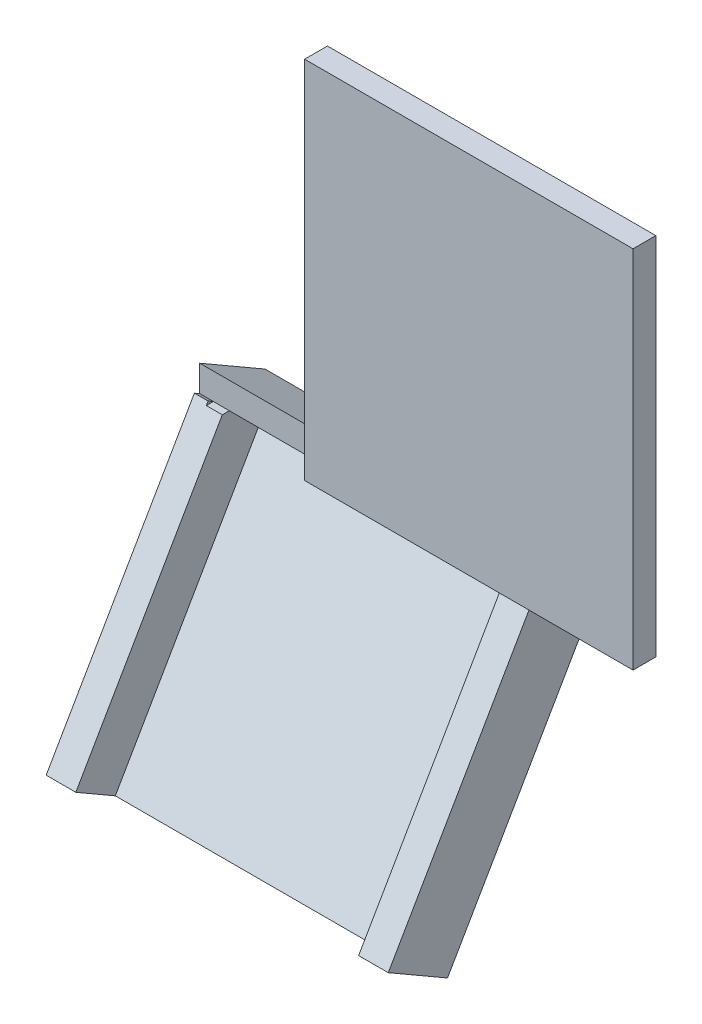
ISO-10303-21;
HEADER;
FILE_DESCRIPTION(('STEP AP214'),'2;1');
FILE_NAME('part.step','',(''),(''),'','','');
FILE_SCHEMA(('AUTOMOTIVE_DESIGN { 1 0 10303 214 1 1 1 1 }'));
ENDSEC;
DATA;
#1=APPLICATION_CONTEXT('core data for automotive mechanical design processes');
#2=APPLICATION_PROTOCOL_DEFINITION('international standard','automotive_design',2000,#1);
#3=PRODUCT_CONTEXT('',#1,'mechanical');
#4=PRODUCT('Part','Part','',(#3));
#5=PRODUCT_RELATED_PRODUCT_CATEGORY('part','',(#4));
#6=PRODUCT_DEFINITION_FORMATION('','',#4);
#7=PRODUCT_DEFINITION_CONTEXT('part definition',#1,'design');
#8=PRODUCT_DEFINITION('design','',#6,#7);
#9=PRODUCT_DEFINITION_SHAPE('','',#8);
#10=(LENGTH_UNIT() NAMED_UNIT(*) SI_UNIT(.MILLI.,.METRE.));
#11=(NAMED_UNIT(*) PLANE_ANGLE_UNIT() SI_UNIT($,.RADIAN.));
#12=(NAMED_UNIT(*) SI_UNIT($,.STERADIAN.) SOLID_ANGLE_UNIT());
#13=UNCERTAINTY_MEASURE_WITH_UNIT(LENGTH_MEASURE(1.E-05),#10,'distance_accuracy_value','');
#14=(GEOMETRIC_REPRESENTATION_CONTEXT(3) GLOBAL_UNCERTAINTY_ASSIGNED_CONTEXT((#13)) GLOBAL_UNIT_ASSIGNED_CONTEXT((#10,
#11,#12)) REPRESENTATION_CONTEXT('',''));
#15=CARTESIAN_POINT('',(0.,0.,0.));
#16=DIRECTION('',(0.,0.,1.));
#17=DIRECTION('',(1.,0.,0.));
#18=AXIS2_PLACEMENT_3D('',#15,#16,#17);
#19=CARTESIAN_POINT('',(0.,0.,1.));
#20=DIRECTION('',(0.,1.,0.));
#21=DIRECTION('',(0.,0.,1.));
#22=AXIS2_PLACEMENT_3D('',#19,#20,#21);
#23=PLANE('',#22);
#24=DIRECTION('',(0.,0.,1.));
#25=VECTOR('',#24,1.);
#26=CARTESIAN_POINT('',(5.,0.,0.));
#27=LINE('',#26,#25);
#28=CARTESIAN_POINT('',(5.,0.,0.));
#29=VERTEX_POINT('',#28);
#30=CARTESIAN_POINT('',(5.,0.,1.));
#31=VERTEX_POINT('',#30);
#32=EDGE_CURVE('E162',#29,#31,#27,.T.);
#33=ORIENTED_EDGE('',*,*,#32,.F.);
#34=DIRECTION('',(1.,0.,0.));
#35=VECTOR('',#34,1.);
#36=CARTESIAN_POINT('',(0.,0.,0.));
#37=LINE('',#36,#35);
#38=CARTESIAN_POINT('',(13.1,0.,0.));
#39=VERTEX_POINT('',#38);
#40=EDGE_CURVE('E179',#29,#39,#37,.T.);
#41=ORIENTED_EDGE('',*,*,#40,.T.);
#42=DIRECTION('',(0.,0.,-1.));
#43=VECTOR('',#42,1.);
#44=CARTESIAN_POINT('',(13.1,0.,0.999999999999999));
#45=LINE('',#44,#43);
#46=CARTESIAN_POINT('',(13.1,0.,0.309401076758494));
#47=VERTEX_POINT('',#46);
#48=EDGE_CURVE('E253',#47,#39,#45,.T.);
#49=ORIENTED_EDGE('',*,*,#48,.F.);
#50=DIRECTION('',(-1.,0.,0.));
#51=VECTOR('',#50,1.);
#52=CARTESIAN_POINT('',(0.,0.,0.309401076758493));
#53=LINE('',#52,#51);
#54=CARTESIAN_POINT('',(14.4,0.,0.309401076758494));
#55=VERTEX_POINT('',#54);
#56=EDGE_CURVE('E255',#55,#47,#53,.T.);
#57=ORIENTED_EDGE('',*,*,#56,.F.);
#58=DIRECTION('',(0.,0.,-1.));
#59=VECTOR('',#58,1.);
#60=CARTESIAN_POINT('',(14.4,0.,1.));
#61=LINE('',#60,#59);
#62=CARTESIAN_POINT('',(14.4,0.,0.));
#63=VERTEX_POINT('',#62);
#64=EDGE_CURVE('E11',#55,#63,#61,.T.);
#65=ORIENTED_EDGE('',*,*,#64,.T.);
#66=DIRECTION('',(-1.,0.,0.));
#67=VECTOR('',#66,1.);
#68=CARTESIAN_POINT('',(19.4,0.,0.));
#69=LINE('',#68,#67);
#70=CARTESIAN_POINT('',(19.4,0.,0.));
#71=VERTEX_POINT('',#70);
#72=EDGE_CURVE('E213',#71,#63,#69,.T.);
#73=ORIENTED_EDGE('',*,*,#72,.F.);
#74=DIRECTION('',(0.,0.,-1.));
#75=VECTOR('',#74,1.);
#76=CARTESIAN_POINT('',(19.4,0.,1.));
#77=LINE('',#76,#75);
#78=CARTESIAN_POINT('',(19.4,0.,1.));
#79=VERTEX_POINT('',#78);
#80=EDGE_CURVE('E321',#79,#71,#77,.T.);
#81=ORIENTED_EDGE('',*,*,#80,.F.);
#82=DIRECTION('',(1.,0.,0.));
#83=VECTOR('',#82,1.);
#84=CARTESIAN_POINT('',(0.,0.,1.));
#85=LINE('',#84,#83);
#86=EDGE_CURVE('E185',#31,#79,#85,.T.);
#87=ORIENTED_EDGE('',*,*,#86,.F.);
#88=EDGE_LOOP('',(#33,#41,#49,#57,#65,#73,#81,#87));
#89=FACE_BOUND('',#88,.T.);
#90=ADVANCED_FACE('F37',(#89),#23,.F.);
#91=CARTESIAN_POINT('',(0.,0.,0.));
#92=DIRECTION('',(0.,0.,-1.));
#93=DIRECTION('',(-1.,0.,0.));
#94=AXIS2_PLACEMENT_3D('',#91,#92,#93);
#95=PLANE('',#94);
#96=DIRECTION('',(-1.,0.,0.));
#97=VECTOR('',#96,1.);
#98=CARTESIAN_POINT('',(0.,1.15470053837924,0.));
#99=LINE('',#98,#97);
#100=CARTESIAN_POINT('',(14.4,1.15470053837923,0.));
#101=VERTEX_POINT('',#100);
#102=CARTESIAN_POINT('',(5.,1.15470053837924,0.));
#103=VERTEX_POINT('',#102);
#104=EDGE_CURVE('E202',#101,#103,#99,.T.);
#105=ORIENTED_EDGE('',*,*,#104,.T.);
#106=DIRECTION('',(0.,-1.,0.));
#107=VECTOR('',#106,1.);
#108=CARTESIAN_POINT('',(5.,16.,0.));
#109=LINE('',#108,#107);
#110=CARTESIAN_POINT('',(5.,16.,0.));
#111=VERTEX_POINT('',#110);
#112=EDGE_CURVE('E165',#111,#103,#109,.T.);
#113=ORIENTED_EDGE('',*,*,#112,.F.);
#114=DIRECTION('',(-1.,0.,0.));
#115=VECTOR('',#114,1.);
#116=CARTESIAN_POINT('',(0.,16.,0.));
#117=LINE('',#116,#115);
#118=CARTESIAN_POINT('',(19.4,16.,0.));
#119=VERTEX_POINT('',#118);
#120=EDGE_CURVE('E178',#119,#111,#117,.T.);
#121=ORIENTED_EDGE('',*,*,#120,.F.);
#122=DIRECTION('',(0.,1.,0.));
#123=VECTOR('',#122,1.);
#124=CARTESIAN_POINT('',(19.4,16.,0.));
#125=LINE('',#124,#123);
#126=EDGE_CURVE('E323',#71,#119,#125,.T.);
#127=ORIENTED_EDGE('',*,*,#126,.F.);
#128=ORIENTED_EDGE('',*,*,#72,.T.);
#129=DIRECTION('',(0.,1.,0.));
#130=VECTOR('',#129,1.);
#131=CARTESIAN_POINT('',(14.4,16.,0.));
#132=LINE('',#131,#130);
#133=EDGE_CURVE('E208',#63,#101,#132,.T.);
#134=ORIENTED_EDGE('',*,*,#133,.T.);
#135=EDGE_LOOP('',(#105,#113,#121,#127,#128,#134));
#136=FACE_BOUND('',#135,.T.);
#137=ADVANCED_FACE('F332',(#136),#95,.T.);
#138=CARTESIAN_POINT('',(0.,16.,1.));
#139=DIRECTION('',(0.,-1.,0.));
#140=DIRECTION('',(0.,0.,-1.));
#141=AXIS2_PLACEMENT_3D('',#138,#139,#140);
#142=PLANE('',#141);
#143=DIRECTION('',(0.,0.,-1.));
#144=VECTOR('',#143,1.);
#145=CARTESIAN_POINT('',(5.,16.,0.));
#146=LINE('',#145,#144);
#147=CARTESIAN_POINT('',(5.,16.,1.));
#148=VERTEX_POINT('',#147);
#149=EDGE_CURVE('E316',#148,#111,#146,.T.);
#150=ORIENTED_EDGE('',*,*,#149,.F.);
#151=DIRECTION('',(-1.,0.,0.));
#152=VECTOR('',#151,1.);
#153=CARTESIAN_POINT('',(0.,16.,1.));
#154=LINE('',#153,#152);
#155=CARTESIAN_POINT('',(19.4,16.,1.));
#156=VERTEX_POINT('',#155);
#157=EDGE_CURVE('E197',#156,#148,#154,.T.);
#158=ORIENTED_EDGE('',*,*,#157,.F.);
#159=DIRECTION('',(0.,0.,1.));
#160=VECTOR('',#159,1.);
#161=CARTESIAN_POINT('',(19.4,16.,1.));
#162=LINE('',#161,#160);
#163=EDGE_CURVE('E325',#119,#156,#162,.T.);
#164=ORIENTED_EDGE('',*,*,#163,.F.);
#165=ORIENTED_EDGE('',*,*,#120,.T.);
#166=EDGE_LOOP('',(#150,#158,#164,#165));
#167=FACE_BOUND('',#166,.T.);
#168=ADVANCED_FACE('F376',(#167),#142,.F.);
#169=CARTESIAN_POINT('',(0.,0.,1.));
#170=DIRECTION('',(0.,0.,-1.));
#171=DIRECTION('',(-1.,0.,0.));
#172=AXIS2_PLACEMENT_3D('',#169,#170,#171);
#173=PLANE('',#172);
#174=DIRECTION('',(0.,1.,0.));
#175=VECTOR('',#174,1.);
#176=CARTESIAN_POINT('',(5.,16.,1.));
#177=LINE('',#176,#175);
#178=EDGE_CURVE('E186',#31,#148,#177,.T.);
#179=ORIENTED_EDGE('',*,*,#178,.F.);
#180=ORIENTED_EDGE('',*,*,#86,.T.);
#181=DIRECTION('',(0.,-1.,0.));
#182=VECTOR('',#181,1.);
#183=CARTESIAN_POINT('',(19.4,16.,1.));
#184=LINE('',#183,#182);
#185=EDGE_CURVE('E212',#156,#79,#184,.T.);
#186=ORIENTED_EDGE('',*,*,#185,.F.);
#187=ORIENTED_EDGE('',*,*,#157,.T.);
#188=EDGE_LOOP('',(#179,#180,#186,#187));
#189=FACE_BOUND('',#188,.T.);
#190=ADVANCED_FACE('F381',(#189),#173,.F.);
#191=CARTESIAN_POINT('',(14.4,0.,1.));
#192=DIRECTION('',(-1.,0.,0.));
#193=DIRECTION('',(0.,0.,1.));
#194=AXIS2_PLACEMENT_3D('',#191,#192,#193);
#195=PLANE('',#194);
#196=ORIENTED_EDGE('',*,*,#133,.F.);
#197=ORIENTED_EDGE('',*,*,#64,.F.);
#198=DIRECTION('',(0.,0.866025403784442,-0.499999999999995));
#199=VECTOR('',#198,1.);
#200=CARTESIAN_POINT('',(14.4,0.133974596215557,0.232050807568872));
#201=LINE('',#200,#199);
#202=CARTESIAN_POINT('',(14.4,-11.1243556529822,6.73205080756881));
#203=VERTEX_POINT('',#202);
#204=EDGE_CURVE('E245',#203,#55,#201,.T.);
#205=ORIENTED_EDGE('',*,*,#204,.F.);
#206=DIRECTION('',(0.,0.499999999999995,0.866025403784442));
#207=VECTOR('',#206,1.);
#208=CARTESIAN_POINT('',(14.4,-11.2583302491977,6.49999999999994));
#209=LINE('',#208,#207);
#210=CARTESIAN_POINT('',(14.4,-12.6243556529822,4.13397459621548));
#211=VERTEX_POINT('',#210);
#212=EDGE_CURVE('E266',#211,#203,#209,.T.);
#213=ORIENTED_EDGE('',*,*,#212,.F.);
#214=DIRECTION('',(0.,-0.866025403784442,0.499999999999995));
#215=VECTOR('',#214,1.);
#216=CARTESIAN_POINT('',(14.4,-1.36602540378443,-2.36602540378445));
#217=LINE('',#216,#215);
#218=CARTESIAN_POINT('',(14.4,-0.499999999999995,-2.86602540378444));
#219=VERTEX_POINT('',#218);
#220=EDGE_CURVE('E268',#219,#211,#217,.T.);
#221=ORIENTED_EDGE('',*,*,#220,.F.);
#222=DIRECTION('',(0.,-0.499999999999995,-0.866025403784442));
#223=VECTOR('',#222,1.);
#224=CARTESIAN_POINT('',(14.4,0.866025403784432,-0.499999999999989));
#225=LINE('',#224,#223);
#226=EDGE_CURVE('E259',#101,#219,#225,.T.);
#227=ORIENTED_EDGE('',*,*,#226,.F.);
#228=EDGE_LOOP('',(#196,#197,#205,#213,#221,#227));
#229=FACE_BOUND('',#228,.T.);
#230=ADVANCED_FACE('F338',(#229),#195,.F.);
#231=CARTESIAN_POINT('',(-0.6,-0.866025403784432,-1.50000000000001));
#232=DIRECTION('',(0.,0.499999999999995,0.866025403784442));
#233=DIRECTION('',(0.,-0.866025403784442,0.499999999999995));
#234=AXIS2_PLACEMENT_3D('',#231,#232,#233);
#235=PLANE('',#234);
#236=DIRECTION('',(1.,0.,0.));
#237=VECTOR('',#236,1.);
#238=CARTESIAN_POINT('',(-0.6,-0.866025403784432,-1.50000000000001));
#239=LINE('',#238,#237);
#240=CARTESIAN_POINT('',(0.700000000000002,-0.866025403784432,-1.50000000000001));
#241=VERTEX_POINT('',#240);
#242=CARTESIAN_POINT('',(13.1,-0.866025403784433,-1.50000000000001));
#243=VERTEX_POINT('',#242);
#244=EDGE_CURVE('E193',#241,#243,#239,.T.);
#245=ORIENTED_EDGE('',*,*,#244,.F.);
#246=DIRECTION('',(0.,0.866025403784442,-0.499999999999995));
#247=VECTOR('',#246,1.);
#248=CARTESIAN_POINT('',(0.7,-0.866025403784433,-1.50000000000001));
#249=LINE('',#248,#247);
#250=CARTESIAN_POINT('',(0.700000000000002,-12.1243556529822,4.99999999999992));
#251=VERTEX_POINT('',#250);
#252=EDGE_CURVE('E60',#251,#241,#249,.T.);
#253=ORIENTED_EDGE('',*,*,#252,.F.);
#254=DIRECTION('',(1.,0.,0.));
#255=VECTOR('',#254,1.);
#256=CARTESIAN_POINT('',(-0.6,-12.1243556529822,4.99999999999992));
#257=LINE('',#256,#255);
#258=CARTESIAN_POINT('',(13.1,-12.1243556529822,4.99999999999992));
#259=VERTEX_POINT('',#258);
#260=EDGE_CURVE('E192',#251,#259,#257,.T.);
#261=ORIENTED_EDGE('',*,*,#260,.T.);
#262=DIRECTION('',(0.,-0.866025403784442,0.499999999999995));
#263=VECTOR('',#262,1.);
#264=CARTESIAN_POINT('',(13.1,-0.866025403784433,-1.50000000000001));
#265=LINE('',#264,#263);
#266=EDGE_CURVE('E241',#243,#259,#265,.T.);
#267=ORIENTED_EDGE('',*,*,#266,.F.);
#268=EDGE_LOOP('',(#245,#253,#261,#267));
#269=FACE_BOUND('',#268,.T.);
#270=ADVANCED_FACE('F386',(#269),#235,.T.);
#271=CARTESIAN_POINT('',(-0.6,0.,0.));
#272=DIRECTION('',(0.,0.866025403784442,-0.499999999999994));
#273=DIRECTION('',(0.,0.499999999999994,0.866025403784442));
#274=AXIS2_PLACEMENT_3D('',#271,#272,#273);
#275=PLANE('',#274);
#276=DIRECTION('',(0.,-0.499999999999995,-0.866025403784442));
#277=VECTOR('',#276,1.);
#278=CARTESIAN_POINT('',(0.7,0.133974596215557,0.232050807568872));
#279=LINE('',#278,#277);
#280=CARTESIAN_POINT('',(0.7,0.,0.));
#281=VERTEX_POINT('',#280);
#282=EDGE_CURVE('E53',#281,#241,#279,.T.);
#283=ORIENTED_EDGE('',*,*,#282,.T.);
#284=ORIENTED_EDGE('',*,*,#244,.T.);
#285=DIRECTION('',(0.,-0.499999999999994,-0.866025403784442));
#286=VECTOR('',#285,1.);
#287=CARTESIAN_POINT('',(13.1,0.,0.));
#288=LINE('',#287,#286);
#289=EDGE_CURVE('E190',#39,#243,#288,.T.);
#290=ORIENTED_EDGE('',*,*,#289,.F.);
#291=ORIENTED_EDGE('',*,*,#40,.F.);
#292=EDGE_CURVE('E172',#281,#29,#37,.T.);
#293=ORIENTED_EDGE('',*,*,#292,.F.);
#294=EDGE_LOOP('',(#283,#284,#290,#291,#293));
#295=FACE_BOUND('',#294,.T.);
#296=ADVANCED_FACE('F188',(#295),#275,.F.);
#297=CARTESIAN_POINT('',(-0.6,0.,0.));
#298=DIRECTION('',(0.,0.,-1.));
#299=DIRECTION('',(-1.,0.,0.));
#300=AXIS2_PLACEMENT_3D('',#297,#298,#299);
#301=PLANE('',#300);
#302=DIRECTION('',(1.,0.,0.));
#303=VECTOR('',#302,1.);
#304=CARTESIAN_POINT('',(-0.6,0.,0.));
#305=LINE('',#304,#303);
#306=CARTESIAN_POINT('',(-0.6,0.,0.));
#307=VERTEX_POINT('',#306);
#308=CARTESIAN_POINT('',(0.,0.,0.));
#309=VERTEX_POINT('',#308);
#310=EDGE_CURVE('E271',#307,#309,#305,.T.);
#311=ORIENTED_EDGE('',*,*,#310,.T.);
#312=DIRECTION('',(-1.,0.,0.));
#313=VECTOR('',#312,1.);
#314=CARTESIAN_POINT('',(5.,0.,0.));
#315=LINE('',#314,#313);
#316=EDGE_CURVE('E176',#281,#309,#315,.T.);
#317=ORIENTED_EDGE('',*,*,#316,.F.);
#318=ORIENTED_EDGE('',*,*,#292,.T.);
#319=EDGE_CURVE('E158',#103,#29,#109,.T.);
#320=ORIENTED_EDGE('',*,*,#319,.F.);
#321=DIRECTION('',(1.,0.,0.));
#322=VECTOR('',#321,1.);
#323=CARTESIAN_POINT('',(-0.6,1.15470053837923,0.));
#324=LINE('',#323,#322);
#325=CARTESIAN_POINT('',(-0.6,1.15470053837923,0.));
#326=VERTEX_POINT('',#325);
#327=EDGE_CURVE('E273',#326,#103,#324,.T.);
#328=ORIENTED_EDGE('',*,*,#327,.F.);
#329=DIRECTION('',(0.,1.,0.));
#330=VECTOR('',#329,1.);
#331=CARTESIAN_POINT('',(-0.6,0.,0.));
#332=LINE('',#331,#330);
#333=EDGE_CURVE('E263',#307,#326,#332,.T.);
#334=ORIENTED_EDGE('',*,*,#333,.F.);
#335=EDGE_LOOP('',(#311,#317,#318,#320,#328,#334));
#336=FACE_BOUND('',#335,.T.);
#337=ADVANCED_FACE('F174',(#336),#301,.F.);
#338=CARTESIAN_POINT('',(-0.6,-11.2583302491977,6.49999999999994));
#339=DIRECTION('',(0.,0.866025403784442,-0.499999999999995));
#340=DIRECTION('',(0.,0.499999999999995,0.866025403784442));
#341=AXIS2_PLACEMENT_3D('',#338,#339,#340);
#342=PLANE('',#341);
#343=ORIENTED_EDGE('',*,*,#212,.T.);
#344=DIRECTION('',(1.,0.,0.));
#345=VECTOR('',#344,1.);
#346=CARTESIAN_POINT('',(14.4,-11.1243556529822,6.73205080756881));
#347=LINE('',#346,#345);
#348=CARTESIAN_POINT('',(13.1,-11.1243556529822,6.73205080756881));
#349=VERTEX_POINT('',#348);
#350=EDGE_CURVE('E244',#349,#203,#347,.T.);
#351=ORIENTED_EDGE('',*,*,#350,.F.);
#352=DIRECTION('',(0.,-0.499999999999995,-0.866025403784442));
#353=VECTOR('',#352,1.);
#354=CARTESIAN_POINT('',(13.1,-11.1243556529822,6.73205080756881));
#355=LINE('',#354,#353);
#356=EDGE_CURVE('E248',#349,#259,#355,.T.);
#357=ORIENTED_EDGE('',*,*,#356,.T.);
#358=ORIENTED_EDGE('',*,*,#260,.F.);
#359=DIRECTION('',(0.,-0.499999999999995,-0.866025403784442));
#360=VECTOR('',#359,1.);
#361=CARTESIAN_POINT('',(0.700000000000002,-11.1243556529822,6.73205080756881));
#362=LINE('',#361,#360);
#363=CARTESIAN_POINT('',(0.700000000000002,-11.1243556529822,6.73205080756881));
#364=VERTEX_POINT('',#363);
#365=EDGE_CURVE('E230',#364,#251,#362,.T.);
#366=ORIENTED_EDGE('',*,*,#365,.F.);
#367=DIRECTION('',(1.,0.,0.));
#368=VECTOR('',#367,1.);
#369=CARTESIAN_POINT('',(-0.6,-11.1243556529822,6.73205080756881));
#370=LINE('',#369,#368);
#371=CARTESIAN_POINT('',(-0.6,-11.1243556529822,6.73205080756881));
#372=VERTEX_POINT('',#371);
#373=EDGE_CURVE('E218',#372,#364,#370,.T.);
#374=ORIENTED_EDGE('',*,*,#373,.F.);
#375=DIRECTION('',(0.,0.499999999999995,0.866025403784442));
#376=VECTOR('',#375,1.);
#377=CARTESIAN_POINT('',(-0.6,-11.2583302491977,6.49999999999994));
#378=LINE('',#377,#376);
#379=CARTESIAN_POINT('',(-0.6,-12.6243556529822,4.13397459621548));
#380=VERTEX_POINT('',#379);
#381=EDGE_CURVE('E256',#380,#372,#378,.T.);
#382=ORIENTED_EDGE('',*,*,#381,.F.);
#383=DIRECTION('',(1.,0.,0.));
#384=VECTOR('',#383,1.);
#385=CARTESIAN_POINT('',(-0.6,-12.6243556529822,4.13397459621548));
#386=LINE('',#385,#384);
#387=EDGE_CURVE('E265',#380,#211,#386,.T.);
#388=ORIENTED_EDGE('',*,*,#387,.T.);
#389=EDGE_LOOP('',(#343,#351,#357,#358,#366,#374,#382,#388));
#390=FACE_BOUND('',#389,.T.);
#391=ADVANCED_FACE('F356',(#390),#342,.F.);
#392=CARTESIAN_POINT('',(-0.6,0.866025403784432,-0.499999999999989));
#393=DIRECTION('',(0.,-0.866025403784442,0.499999999999995));
#394=DIRECTION('',(0.,-0.499999999999995,-0.866025403784442));
#395=AXIS2_PLACEMENT_3D('',#392,#393,#394);
#396=PLANE('',#395);
#397=ORIENTED_EDGE('',*,*,#226,.T.);
#398=DIRECTION('',(1.,0.,0.));
#399=VECTOR('',#398,1.);
#400=CARTESIAN_POINT('',(-0.6,-0.499999999999995,-2.86602540378444));
#401=LINE('',#400,#399);
#402=CARTESIAN_POINT('',(-0.6,-0.499999999999995,-2.86602540378444));
#403=VERTEX_POINT('',#402);
#404=EDGE_CURVE('E274',#403,#219,#401,.T.);
#405=ORIENTED_EDGE('',*,*,#404,.F.);
#406=DIRECTION('',(0.,-0.499999999999995,-0.866025403784442));
#407=VECTOR('',#406,1.);
#408=CARTESIAN_POINT('',(-0.6,0.866025403784432,-0.499999999999989));
#409=LINE('',#408,#407);
#410=EDGE_CURVE('E261',#326,#403,#409,.T.);
#411=ORIENTED_EDGE('',*,*,#410,.F.);
#412=ORIENTED_EDGE('',*,*,#327,.T.);
#413=ORIENTED_EDGE('',*,*,#104,.F.);
#414=EDGE_LOOP('',(#397,#405,#411,#412,#413));
#415=FACE_BOUND('',#414,.T.);
#416=ADVANCED_FACE('F291',(#415),#396,.F.);
#417=CARTESIAN_POINT('',(-0.6,-1.36602540378443,-2.36602540378445));
#418=DIRECTION('',(0.,0.499999999999995,0.866025403784442));
#419=DIRECTION('',(0.,-0.866025403784442,0.499999999999995));
#420=AXIS2_PLACEMENT_3D('',#417,#418,#419);
#421=PLANE('',#420);
#422=ORIENTED_EDGE('',*,*,#220,.T.);
#423=ORIENTED_EDGE('',*,*,#387,.F.);
#424=DIRECTION('',(0.,-0.866025403784442,0.499999999999995));
#425=VECTOR('',#424,1.);
#426=CARTESIAN_POINT('',(-0.6,-1.36602540378443,-2.36602540378445));
#427=LINE('',#426,#425);
#428=EDGE_CURVE('E258',#403,#380,#427,.T.);
#429=ORIENTED_EDGE('',*,*,#428,.F.);
#430=ORIENTED_EDGE('',*,*,#404,.T.);
#431=EDGE_LOOP('',(#422,#423,#429,#430));
#432=FACE_BOUND('',#431,.T.);
#433=ADVANCED_FACE('F360',(#432),#421,.F.);
#434=CARTESIAN_POINT('',(-0.6,0.,0.));
#435=DIRECTION('',(1.,0.,0.));
#436=DIRECTION('',(0.,0.,-1.));
#437=AXIS2_PLACEMENT_3D('',#434,#435,#436);
#438=PLANE('',#437);
#439=DIRECTION('',(0.,-0.499999999999995,-0.866025403784442));
#440=VECTOR('',#439,1.);
#441=CARTESIAN_POINT('',(-0.6,0.133974596215557,0.232050807568872));
#442=LINE('',#441,#440);
#443=CARTESIAN_POINT('',(-0.6,0.133974596215557,0.232050807568872));
#444=VERTEX_POINT('',#443);
#445=EDGE_CURVE('E225',#444,#307,#442,.T.);
#446=ORIENTED_EDGE('',*,*,#445,.T.);
#447=ORIENTED_EDGE('',*,*,#333,.T.);
#448=ORIENTED_EDGE('',*,*,#410,.T.);
#449=ORIENTED_EDGE('',*,*,#428,.T.);
#450=ORIENTED_EDGE('',*,*,#381,.T.);
#451=DIRECTION('',(0.,-0.866025403784442,0.499999999999995));
#452=VECTOR('',#451,1.);
#453=CARTESIAN_POINT('',(-0.6,0.133974596215557,0.232050807568872));
#454=LINE('',#453,#452);
#455=EDGE_CURVE('E215',#444,#372,#454,.T.);
#456=ORIENTED_EDGE('',*,*,#455,.F.);
#457=EDGE_LOOP('',(#446,#447,#448,#449,#450,#456));
#458=FACE_BOUND('',#457,.T.);
#459=ADVANCED_FACE('F300',(#458),#438,.F.);
#460=CARTESIAN_POINT('',(0.,0.133974596215556,0.232050807568871));
#461=DIRECTION('',(0.,-0.499999999999995,-0.866025403784442));
#462=DIRECTION('',(0.,0.866025403784442,-0.499999999999995));
#463=AXIS2_PLACEMENT_3D('',#460,#461,#462);
#464=PLANE('',#463);
#465=ORIENTED_EDGE('',*,*,#204,.T.);
#466=ORIENTED_EDGE('',*,*,#56,.T.);
#467=DIRECTION('',(0.,-0.866025403784442,0.499999999999995));
#468=VECTOR('',#467,1.);
#469=CARTESIAN_POINT('',(13.1,0.133974596215557,0.232050807568872));
#470=LINE('',#469,#468);
#471=EDGE_CURVE('E242',#47,#349,#470,.T.);
#472=ORIENTED_EDGE('',*,*,#471,.T.);
#473=ORIENTED_EDGE('',*,*,#350,.T.);
#474=EDGE_LOOP('',(#465,#466,#472,#473));
#475=FACE_BOUND('',#474,.T.);
#476=ADVANCED_FACE('F349',(#475),#464,.F.);
#477=CARTESIAN_POINT('',(13.1,0.133974596215557,0.232050807568872));
#478=DIRECTION('',(1.,0.,0.));
#479=DIRECTION('',(0.,1.,0.));
#480=AXIS2_PLACEMENT_3D('',#477,#478,#479);
#481=PLANE('',#480);
#482=ORIENTED_EDGE('',*,*,#471,.F.);
#483=ORIENTED_EDGE('',*,*,#48,.T.);
#484=ORIENTED_EDGE('',*,*,#289,.T.);
#485=ORIENTED_EDGE('',*,*,#266,.T.);
#486=ORIENTED_EDGE('',*,*,#356,.F.);
#487=EDGE_LOOP('',(#482,#483,#484,#485,#486));
#488=FACE_BOUND('',#487,.T.);
#489=ADVANCED_FACE('F352',(#488),#481,.F.);
#490=CARTESIAN_POINT('',(0.,0.133974596215556,0.232050807568872));
#491=DIRECTION('',(0.,0.499999999999995,0.866025403784442));
#492=DIRECTION('',(0.,-0.866025403784442,0.499999999999995));
#493=AXIS2_PLACEMENT_3D('',#490,#491,#492);
#494=PLANE('',#493);
#495=DIRECTION('',(1.,0.,0.));
#496=VECTOR('',#495,1.);
#497=CARTESIAN_POINT('',(0.,0.,0.309401076758493));
#498=LINE('',#497,#496);
#499=CARTESIAN_POINT('',(0.,0.,0.309401076758493));
#500=VERTEX_POINT('',#499);
#501=CARTESIAN_POINT('',(0.7,0.,0.309401076758493));
#502=VERTEX_POINT('',#501);
#503=EDGE_CURVE('E239',#500,#502,#498,.T.);
#504=ORIENTED_EDGE('',*,*,#503,.F.);
#505=DIRECTION('',(0.,-0.866025403784442,0.499999999999995));
#506=VECTOR('',#505,1.);
#507=CARTESIAN_POINT('',(0.,-0.29903810567666,0.482050807568867));
#508=LINE('',#507,#506);
#509=CARTESIAN_POINT('',(0.,0.133974596215557,0.232050807568872));
#510=VERTEX_POINT('',#509);
#511=EDGE_CURVE('E45',#510,#500,#508,.T.);
#512=ORIENTED_EDGE('',*,*,#511,.F.);
#513=DIRECTION('',(-1.,0.,0.));
#514=VECTOR('',#513,1.);
#515=CARTESIAN_POINT('',(-0.6,0.133974596215557,0.232050807568872));
#516=LINE('',#515,#514);
#517=EDGE_CURVE('E223',#510,#444,#516,.T.);
#518=ORIENTED_EDGE('',*,*,#517,.T.);
#519=ORIENTED_EDGE('',*,*,#455,.T.);
#520=ORIENTED_EDGE('',*,*,#373,.T.);
#521=DIRECTION('',(0.,0.866025403784442,-0.499999999999995));
#522=VECTOR('',#521,1.);
#523=CARTESIAN_POINT('',(0.7,0.133974596215557,0.232050807568872));
#524=LINE('',#523,#522);
#525=EDGE_CURVE('E220',#364,#502,#524,.T.);
#526=ORIENTED_EDGE('',*,*,#525,.T.);
#527=EDGE_LOOP('',(#504,#512,#518,#519,#520,#526));
#528=FACE_BOUND('',#527,.T.);
#529=ADVANCED_FACE('F305',(#528),#494,.T.);
#530=CARTESIAN_POINT('',(0.7,0.133974596215557,0.232050807568872));
#531=DIRECTION('',(-1.,0.,0.));
#532=DIRECTION('',(0.,-1.,0.));
#533=AXIS2_PLACEMENT_3D('',#530,#531,#532);
#534=PLANE('',#533);
#535=ORIENTED_EDGE('',*,*,#282,.F.);
#536=DIRECTION('',(0.,0.,1.));
#537=VECTOR('',#536,1.);
#538=CARTESIAN_POINT('',(0.7,0.,1.));
#539=LINE('',#538,#537);
#540=EDGE_CURVE('E236',#281,#502,#539,.T.);
#541=ORIENTED_EDGE('',*,*,#540,.T.);
#542=ORIENTED_EDGE('',*,*,#525,.F.);
#543=ORIENTED_EDGE('',*,*,#365,.T.);
#544=ORIENTED_EDGE('',*,*,#252,.T.);
#545=EDGE_LOOP('',(#535,#541,#542,#543,#544));
#546=FACE_BOUND('',#545,.T.);
#547=ADVANCED_FACE('F406',(#546),#534,.F.);
#548=CARTESIAN_POINT('',(-0.6,0.133974596215557,0.232050807568872));
#549=DIRECTION('',(0.,-0.866025403784442,0.499999999999995));
#550=DIRECTION('',(0.,-0.499999999999995,-0.866025403784442));
#551=AXIS2_PLACEMENT_3D('',#548,#549,#550);
#552=PLANE('',#551);
#553=ORIENTED_EDGE('',*,*,#517,.F.);
#554=DIRECTION('',(0.,-0.499999999999995,-0.866025403784442));
#555=VECTOR('',#554,1.);
#556=CARTESIAN_POINT('',(0.,0.433012701892217,0.750000000000005));
#557=LINE('',#556,#555);
#558=EDGE_CURVE('E233',#510,#309,#557,.T.);
#559=ORIENTED_EDGE('',*,*,#558,.T.);
#560=ORIENTED_EDGE('',*,*,#310,.F.);
#561=ORIENTED_EDGE('',*,*,#445,.F.);
#562=EDGE_LOOP('',(#553,#559,#560,#561));
#563=FACE_BOUND('',#562,.T.);
#564=ADVANCED_FACE('F298',(#563),#552,.F.);
#565=CARTESIAN_POINT('',(19.4,0.,0.));
#566=DIRECTION('',(1.,0.,0.));
#567=DIRECTION('',(0.,0.,-1.));
#568=AXIS2_PLACEMENT_3D('',#565,#566,#567);
#569=PLANE('',#568);
#570=ORIENTED_EDGE('',*,*,#185,.T.);
#571=ORIENTED_EDGE('',*,*,#80,.T.);
#572=ORIENTED_EDGE('',*,*,#126,.T.);
#573=ORIENTED_EDGE('',*,*,#163,.T.);
#574=EDGE_LOOP('',(#570,#571,#572,#573));
#575=FACE_BOUND('',#574,.T.);
#576=ADVANCED_FACE('F398',(#575),#569,.T.);
#577=CARTESIAN_POINT('',(5.,0.,0.));
#578=DIRECTION('',(0.,-1.,0.));
#579=DIRECTION('',(0.,0.,-1.));
#580=AXIS2_PLACEMENT_3D('',#577,#578,#579);
#581=PLANE('',#580);
#582=ORIENTED_EDGE('',*,*,#503,.T.);
#583=ORIENTED_EDGE('',*,*,#540,.F.);
#584=ORIENTED_EDGE('',*,*,#316,.T.);
#585=DIRECTION('',(0.,0.,1.));
#586=VECTOR('',#585,1.);
#587=CARTESIAN_POINT('',(0.,0.,0.));
#588=LINE('',#587,#586);
#589=EDGE_CURVE('E169',#309,#500,#588,.T.);
#590=ORIENTED_EDGE('',*,*,#589,.T.);
#591=EDGE_LOOP('',(#582,#583,#584,#590));
#592=FACE_BOUND('',#591,.T.);
#593=ADVANCED_FACE('F312',(#592),#581,.F.);
#594=CARTESIAN_POINT('',(5.,0.,0.));
#595=DIRECTION('',(-1.,0.,0.));
#596=DIRECTION('',(0.,0.,1.));
#597=AXIS2_PLACEMENT_3D('',#594,#595,#596);
#598=PLANE('',#597);
#599=ORIENTED_EDGE('',*,*,#112,.T.);
#600=ORIENTED_EDGE('',*,*,#319,.T.);
#601=ORIENTED_EDGE('',*,*,#32,.T.);
#602=ORIENTED_EDGE('',*,*,#178,.T.);
#603=ORIENTED_EDGE('',*,*,#149,.T.);
#604=EDGE_LOOP('',(#599,#600,#601,#602,#603));
#605=FACE_BOUND('',#604,.T.);
#606=ADVANCED_FACE('F160',(#605),#598,.T.);
#607=CARTESIAN_POINT('',(0.,0.,0.));
#608=DIRECTION('',(-1.,0.,0.));
#609=DIRECTION('',(0.,0.,1.));
#610=AXIS2_PLACEMENT_3D('',#607,#608,#609);
#611=PLANE('',#610);
#612=ORIENTED_EDGE('',*,*,#511,.T.);
#613=ORIENTED_EDGE('',*,*,#589,.F.);
#614=ORIENTED_EDGE('',*,*,#558,.F.);
#615=EDGE_LOOP('',(#612,#613,#614));
#616=FACE_BOUND('',#615,.T.);
#617=ADVANCED_FACE('F310',(#616),#611,.F.);
#618=CLOSED_SHELL('',(#90,#137,#168,#190,#230,#270,#296,#337,#391,#416,#433,#459,#476,#489,#529,
#547,#564,#576,#593,#606,#617));
#619=MANIFOLD_SOLID_BREP('B2',#618);
#620=ADVANCED_BREP_SHAPE_REPRESENTATION('',(#18,#619),#14);
#621=SHAPE_DEFINITION_REPRESENTATION(#9,#620);
ENDSEC;
END-ISO-10303-21;
